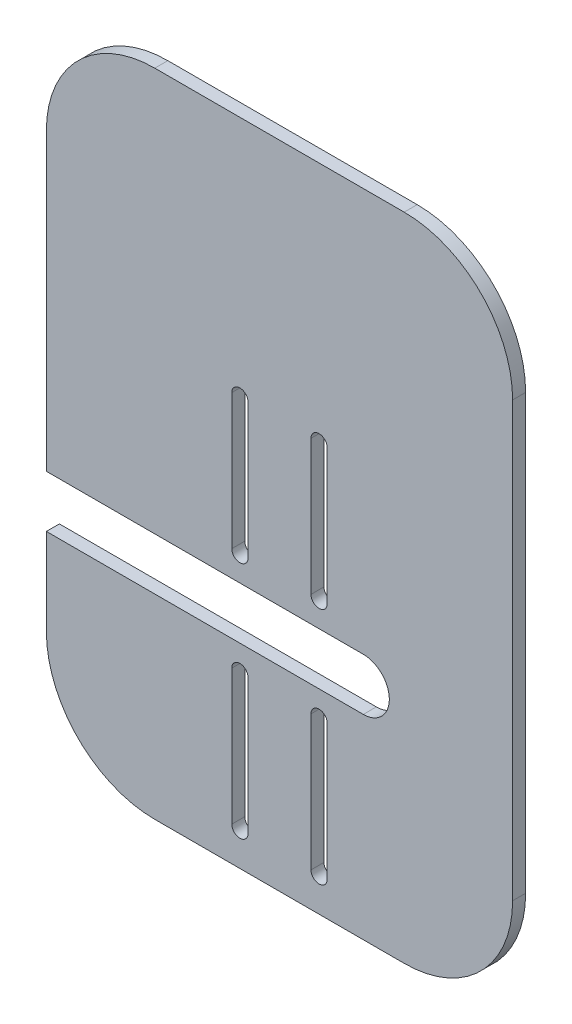
ISO-10303-21;
HEADER;
FILE_DESCRIPTION(('STEP AP214'),'2;1');
FILE_NAME('part.step','',(''),(''),'','','');
FILE_SCHEMA(('AUTOMOTIVE_DESIGN { 1 0 10303 214 1 1 1 1 }'));
ENDSEC;
DATA;
#1=APPLICATION_CONTEXT('core data for automotive mechanical design processes');
#2=APPLICATION_PROTOCOL_DEFINITION('international standard','automotive_design',2000,#1);
#3=PRODUCT_CONTEXT('',#1,'mechanical');
#4=PRODUCT('Part','Part','',(#3));
#5=PRODUCT_RELATED_PRODUCT_CATEGORY('part','',(#4));
#6=PRODUCT_DEFINITION_FORMATION('','',#4);
#7=PRODUCT_DEFINITION_CONTEXT('part definition',#1,'design');
#8=PRODUCT_DEFINITION('design','',#6,#7);
#9=PRODUCT_DEFINITION_SHAPE('','',#8);
#10=(LENGTH_UNIT() NAMED_UNIT(*) SI_UNIT(.MILLI.,.METRE.));
#11=(NAMED_UNIT(*) PLANE_ANGLE_UNIT() SI_UNIT($,.RADIAN.));
#12=(NAMED_UNIT(*) SI_UNIT($,.STERADIAN.) SOLID_ANGLE_UNIT());
#13=UNCERTAINTY_MEASURE_WITH_UNIT(LENGTH_MEASURE(1.E-05),#10,'distance_accuracy_value','');
#14=(GEOMETRIC_REPRESENTATION_CONTEXT(3) GLOBAL_UNCERTAINTY_ASSIGNED_CONTEXT((#13)) GLOBAL_UNIT_ASSIGNED_CONTEXT((#10,
#11,#12)) REPRESENTATION_CONTEXT('',''));
#15=CARTESIAN_POINT('',(0.,0.,0.));
#16=DIRECTION('',(0.,0.,1.));
#17=DIRECTION('',(1.,0.,0.));
#18=AXIS2_PLACEMENT_3D('',#15,#16,#17);
#19=CARTESIAN_POINT('',(-53.1286344218914,-25.5475887011216,3.));
#20=DIRECTION('',(0.,0.,-1.));
#21=DIRECTION('',(-1.,0.,0.));
#22=AXIS2_PLACEMENT_3D('',#19,#20,#21);
#23=CYLINDRICAL_SURFACE('',#22,5.99999999999999);
#24=CARTESIAN_POINT('',(-53.1286344218914,-25.5475887011216,0.));
#25=DIRECTION('',(0.,0.,-1.));
#26=DIRECTION('',(1.,0.,0.));
#27=AXIS2_PLACEMENT_3D('',#24,#25,#26);
#28=CIRCLE('',#27,5.99999999999999);
#29=CARTESIAN_POINT('',(-53.1286344218914,-19.5475887011216,0.));
#30=VERTEX_POINT('',#29);
#31=CARTESIAN_POINT('',(-53.1286344218914,-31.5475887011216,0.));
#32=VERTEX_POINT('',#31);
#33=EDGE_CURVE('E299',#30,#32,#28,.T.);
#34=ORIENTED_EDGE('',*,*,#33,.T.);
#35=DIRECTION('',(0.,0.,-1.));
#36=VECTOR('',#35,1.);
#37=CARTESIAN_POINT('',(-53.1286344218914,-31.5475887011216,3.));
#38=LINE('',#37,#36);
#39=CARTESIAN_POINT('',(-53.1286344218914,-31.5475887011216,3.));
#40=VERTEX_POINT('',#39);
#41=EDGE_CURVE('E389',#40,#32,#38,.T.);
#42=ORIENTED_EDGE('',*,*,#41,.F.);
#43=CARTESIAN_POINT('',(-53.1286344218914,-25.5475887011216,3.));
#44=DIRECTION('',(0.,0.,-1.));
#45=DIRECTION('',(1.,0.,0.));
#46=AXIS2_PLACEMENT_3D('',#43,#44,#45);
#47=CIRCLE('',#46,5.99999999999999);
#48=CARTESIAN_POINT('',(-53.1286344218914,-19.5475887011216,3.));
#49=VERTEX_POINT('',#48);
#50=EDGE_CURVE('E306',#49,#40,#47,.T.);
#51=ORIENTED_EDGE('',*,*,#50,.F.);
#52=DIRECTION('',(0.,0.,-1.));
#53=VECTOR('',#52,1.);
#54=CARTESIAN_POINT('',(-53.1286344218914,-19.5475887011216,3.));
#55=LINE('',#54,#53);
#56=EDGE_CURVE('E332',#49,#30,#55,.T.);
#57=ORIENTED_EDGE('',*,*,#56,.T.);
#58=EDGE_LOOP('',(#34,#42,#51,#57));
#59=FACE_BOUND('',#58,.T.);
#60=ADVANCED_FACE('F33',(#59),#23,.F.);
#61=CARTESIAN_POINT('',(-62.7468099752932,-31.5475887011216,3.));
#62=DIRECTION('',(0.,-1.,0.));
#63=DIRECTION('',(1.,0.,0.));
#64=AXIS2_PLACEMENT_3D('',#61,#62,#63);
#65=PLANE('',#64);
#66=DIRECTION('',(-1.,0.,0.));
#67=VECTOR('',#66,1.);
#68=CARTESIAN_POINT('',(-62.7468099752932,-31.5475887011216,0.));
#69=LINE('',#68,#67);
#70=CARTESIAN_POINT('',(-126.203620944525,-31.5475887011216,0.));
#71=VERTEX_POINT('',#70);
#72=EDGE_CURVE('E335',#32,#71,#69,.T.);
#73=ORIENTED_EDGE('',*,*,#72,.T.);
#74=DIRECTION('',(0.,0.,-1.));
#75=VECTOR('',#74,1.);
#76=CARTESIAN_POINT('',(-126.203620944525,-31.5475887011216,3.));
#77=LINE('',#76,#75);
#78=CARTESIAN_POINT('',(-126.203620944525,-31.5475887011216,3.));
#79=VERTEX_POINT('',#78);
#80=EDGE_CURVE('E386',#79,#71,#77,.T.);
#81=ORIENTED_EDGE('',*,*,#80,.F.);
#82=DIRECTION('',(-1.,0.,0.));
#83=VECTOR('',#82,1.);
#84=CARTESIAN_POINT('',(-53.1286344218914,-31.5475887011216,3.));
#85=LINE('',#84,#83);
#86=EDGE_CURVE('E309',#40,#79,#85,.T.);
#87=ORIENTED_EDGE('',*,*,#86,.F.);
#88=ORIENTED_EDGE('',*,*,#41,.T.);
#89=EDGE_LOOP('',(#73,#81,#87,#88));
#90=FACE_BOUND('',#89,.T.);
#91=ADVANCED_FACE('F452',(#90),#65,.F.);
#92=CARTESIAN_POINT('',(-126.203620944525,-31.5475887011216,3.));
#93=DIRECTION('',(1.,0.,0.));
#94=DIRECTION('',(0.,0.,-1.));
#95=AXIS2_PLACEMENT_3D('',#92,#93,#94);
#96=PLANE('',#95);
#97=DIRECTION('',(0.,-1.,0.));
#98=VECTOR('',#97,1.);
#99=CARTESIAN_POINT('',(-126.203620944525,-31.5475887011216,0.));
#100=LINE('',#99,#98);
#101=CARTESIAN_POINT('',(-126.203620944525,-51.5475887011216,0.));
#102=VERTEX_POINT('',#101);
#103=EDGE_CURVE('E337',#71,#102,#100,.T.);
#104=ORIENTED_EDGE('',*,*,#103,.T.);
#105=DIRECTION('',(0.,0.,-1.));
#106=VECTOR('',#105,1.);
#107=CARTESIAN_POINT('',(-126.203620944525,-51.5475887011216,3.));
#108=LINE('',#107,#106);
#109=CARTESIAN_POINT('',(-126.203620944525,-51.5475887011216,3.));
#110=VERTEX_POINT('',#109);
#111=EDGE_CURVE('E383',#110,#102,#108,.T.);
#112=ORIENTED_EDGE('',*,*,#111,.F.);
#113=DIRECTION('',(0.,-1.,0.));
#114=VECTOR('',#113,1.);
#115=CARTESIAN_POINT('',(-126.203620944525,-31.5475887011216,3.));
#116=LINE('',#115,#114);
#117=EDGE_CURVE('E312',#79,#110,#116,.T.);
#118=ORIENTED_EDGE('',*,*,#117,.F.);
#119=ORIENTED_EDGE('',*,*,#80,.T.);
#120=EDGE_LOOP('',(#104,#112,#118,#119));
#121=FACE_BOUND('',#120,.T.);
#122=ADVANCED_FACE('F457',(#121),#96,.F.);
#123=CARTESIAN_POINT('',(-101.203620944525,-51.5475887011216,3.));
#124=DIRECTION('',(0.,0.,-1.));
#125=DIRECTION('',(-1.,0.,0.));
#126=AXIS2_PLACEMENT_3D('',#123,#124,#125);
#127=CYLINDRICAL_SURFACE('',#126,25.);
#128=CARTESIAN_POINT('',(-101.203620944525,-51.5475887011216,0.));
#129=DIRECTION('',(0.,0.,1.));
#130=DIRECTION('',(-1.,0.,0.));
#131=AXIS2_PLACEMENT_3D('',#128,#129,#130);
#132=CIRCLE('',#131,25.);
#133=CARTESIAN_POINT('',(-101.203620944525,-76.5475887011216,0.));
#134=VERTEX_POINT('',#133);
#135=EDGE_CURVE('E339',#102,#134,#132,.T.);
#136=ORIENTED_EDGE('',*,*,#135,.T.);
#137=DIRECTION('',(0.,0.,-1.));
#138=VECTOR('',#137,1.);
#139=CARTESIAN_POINT('',(-101.203620944525,-76.5475887011216,3.));
#140=LINE('',#139,#138);
#141=CARTESIAN_POINT('',(-101.203620944525,-76.5475887011216,3.));
#142=VERTEX_POINT('',#141);
#143=EDGE_CURVE('E380',#142,#134,#140,.T.);
#144=ORIENTED_EDGE('',*,*,#143,.F.);
#145=CARTESIAN_POINT('',(-101.203620944525,-51.5475887011216,3.));
#146=DIRECTION('',(0.,0.,1.));
#147=DIRECTION('',(-1.,0.,0.));
#148=AXIS2_PLACEMENT_3D('',#145,#146,#147);
#149=CIRCLE('',#148,25.);
#150=EDGE_CURVE('E314',#110,#142,#149,.T.);
#151=ORIENTED_EDGE('',*,*,#150,.F.);
#152=ORIENTED_EDGE('',*,*,#111,.T.);
#153=EDGE_LOOP('',(#136,#144,#151,#152));
#154=FACE_BOUND('',#153,.T.);
#155=ADVANCED_FACE('F509',(#154),#127,.T.);
#156=CARTESIAN_POINT('',(-101.203620944525,-76.5475887011216,3.));
#157=DIRECTION('',(0.,1.,0.));
#158=DIRECTION('',(0.,0.,1.));
#159=AXIS2_PLACEMENT_3D('',#156,#157,#158);
#160=PLANE('',#159);
#161=DIRECTION('',(1.,0.,0.));
#162=VECTOR('',#161,1.);
#163=CARTESIAN_POINT('',(-101.203620944525,-76.5475887011216,0.));
#164=LINE('',#163,#162);
#165=CARTESIAN_POINT('',(-43.7036209445248,-76.5475887011216,0.));
#166=VERTEX_POINT('',#165);
#167=EDGE_CURVE('E341',#134,#166,#164,.T.);
#168=ORIENTED_EDGE('',*,*,#167,.T.);
#169=DIRECTION('',(0.,0.,-1.));
#170=VECTOR('',#169,1.);
#171=CARTESIAN_POINT('',(-43.7036209445248,-76.5475887011216,3.));
#172=LINE('',#171,#170);
#173=CARTESIAN_POINT('',(-43.7036209445248,-76.5475887011216,3.));
#174=VERTEX_POINT('',#173);
#175=EDGE_CURVE('E377',#174,#166,#172,.T.);
#176=ORIENTED_EDGE('',*,*,#175,.F.);
#177=DIRECTION('',(1.,0.,0.));
#178=VECTOR('',#177,1.);
#179=CARTESIAN_POINT('',(-101.203620944525,-76.5475887011216,3.));
#180=LINE('',#179,#178);
#181=EDGE_CURVE('E316',#142,#174,#180,.T.);
#182=ORIENTED_EDGE('',*,*,#181,.F.);
#183=ORIENTED_EDGE('',*,*,#143,.T.);
#184=EDGE_LOOP('',(#168,#176,#182,#183));
#185=FACE_BOUND('',#184,.T.);
#186=ADVANCED_FACE('F506',(#185),#160,.F.);
#187=CARTESIAN_POINT('',(-43.7036209445248,-51.5475887011216,3.));
#188=DIRECTION('',(0.,0.,-1.));
#189=DIRECTION('',(-1.,0.,0.));
#190=AXIS2_PLACEMENT_3D('',#187,#188,#189);
#191=CYLINDRICAL_SURFACE('',#190,25.);
#192=CARTESIAN_POINT('',(-43.7036209445248,-51.5475887011216,0.));
#193=DIRECTION('',(0.,0.,1.));
#194=DIRECTION('',(-1.,0.,0.));
#195=AXIS2_PLACEMENT_3D('',#192,#193,#194);
#196=CIRCLE('',#195,25.);
#197=CARTESIAN_POINT('',(-18.7036209445248,-51.5475887011216,0.));
#198=VERTEX_POINT('',#197);
#199=EDGE_CURVE('E343',#166,#198,#196,.T.);
#200=ORIENTED_EDGE('',*,*,#199,.T.);
#201=DIRECTION('',(0.,0.,-1.));
#202=VECTOR('',#201,1.);
#203=CARTESIAN_POINT('',(-18.7036209445248,-51.5475887011216,3.));
#204=LINE('',#203,#202);
#205=CARTESIAN_POINT('',(-18.7036209445248,-51.5475887011216,3.));
#206=VERTEX_POINT('',#205);
#207=EDGE_CURVE('E374',#206,#198,#204,.T.);
#208=ORIENTED_EDGE('',*,*,#207,.F.);
#209=CARTESIAN_POINT('',(-43.7036209445248,-51.5475887011216,3.));
#210=DIRECTION('',(0.,0.,1.));
#211=DIRECTION('',(-1.,0.,0.));
#212=AXIS2_PLACEMENT_3D('',#209,#210,#211);
#213=CIRCLE('',#212,25.);
#214=EDGE_CURVE('E318',#174,#206,#213,.T.);
#215=ORIENTED_EDGE('',*,*,#214,.F.);
#216=ORIENTED_EDGE('',*,*,#175,.T.);
#217=EDGE_LOOP('',(#200,#208,#215,#216));
#218=FACE_BOUND('',#217,.T.);
#219=ADVANCED_FACE('F502',(#218),#191,.T.);
#220=CARTESIAN_POINT('',(-18.7036209445248,48.4524112988784,3.));
#221=DIRECTION('',(-1.,0.,0.));
#222=DIRECTION('',(0.,0.,1.));
#223=AXIS2_PLACEMENT_3D('',#220,#221,#222);
#224=PLANE('',#223);
#225=DIRECTION('',(0.,1.,0.));
#226=VECTOR('',#225,1.);
#227=CARTESIAN_POINT('',(-18.7036209445248,48.4524112988784,0.));
#228=LINE('',#227,#226);
#229=CARTESIAN_POINT('',(-18.7036209445248,48.4524112988784,0.));
#230=VERTEX_POINT('',#229);
#231=EDGE_CURVE('E345',#198,#230,#228,.T.);
#232=ORIENTED_EDGE('',*,*,#231,.T.);
#233=DIRECTION('',(0.,0.,-1.));
#234=VECTOR('',#233,1.);
#235=CARTESIAN_POINT('',(-18.7036209445248,48.4524112988784,3.));
#236=LINE('',#235,#234);
#237=CARTESIAN_POINT('',(-18.7036209445248,48.4524112988784,3.));
#238=VERTEX_POINT('',#237);
#239=EDGE_CURVE('E371',#238,#230,#236,.T.);
#240=ORIENTED_EDGE('',*,*,#239,.F.);
#241=DIRECTION('',(0.,1.,0.));
#242=VECTOR('',#241,1.);
#243=CARTESIAN_POINT('',(-18.7036209445248,48.4524112988784,3.));
#244=LINE('',#243,#242);
#245=EDGE_CURVE('E320',#206,#238,#244,.T.);
#246=ORIENTED_EDGE('',*,*,#245,.F.);
#247=ORIENTED_EDGE('',*,*,#207,.T.);
#248=EDGE_LOOP('',(#232,#240,#246,#247));
#249=FACE_BOUND('',#248,.T.);
#250=ADVANCED_FACE('F497',(#249),#224,.F.);
#251=CARTESIAN_POINT('',(-43.7036209445248,48.4524112988784,3.));
#252=DIRECTION('',(0.,0.,-1.));
#253=DIRECTION('',(-1.,0.,0.));
#254=AXIS2_PLACEMENT_3D('',#251,#252,#253);
#255=CYLINDRICAL_SURFACE('',#254,25.);
#256=CARTESIAN_POINT('',(-43.7036209445248,48.4524112988784,0.));
#257=DIRECTION('',(0.,0.,1.));
#258=DIRECTION('',(-1.,0.,0.));
#259=AXIS2_PLACEMENT_3D('',#256,#257,#258);
#260=CIRCLE('',#259,25.);
#261=CARTESIAN_POINT('',(-43.7036209445248,73.4524112988784,0.));
#262=VERTEX_POINT('',#261);
#263=EDGE_CURVE('E347',#230,#262,#260,.T.);
#264=ORIENTED_EDGE('',*,*,#263,.T.);
#265=DIRECTION('',(0.,0.,-1.));
#266=VECTOR('',#265,1.);
#267=CARTESIAN_POINT('',(-43.7036209445248,73.4524112988784,3.));
#268=LINE('',#267,#266);
#269=CARTESIAN_POINT('',(-43.7036209445248,73.4524112988784,3.));
#270=VERTEX_POINT('',#269);
#271=EDGE_CURVE('E368',#270,#262,#268,.T.);
#272=ORIENTED_EDGE('',*,*,#271,.F.);
#273=CARTESIAN_POINT('',(-43.7036209445248,48.4524112988784,3.));
#274=DIRECTION('',(0.,0.,1.));
#275=DIRECTION('',(-1.,0.,0.));
#276=AXIS2_PLACEMENT_3D('',#273,#274,#275);
#277=CIRCLE('',#276,25.);
#278=EDGE_CURVE('E322',#238,#270,#277,.T.);
#279=ORIENTED_EDGE('',*,*,#278,.F.);
#280=ORIENTED_EDGE('',*,*,#239,.T.);
#281=EDGE_LOOP('',(#264,#272,#279,#280));
#282=FACE_BOUND('',#281,.T.);
#283=ADVANCED_FACE('F491',(#282),#255,.T.);
#284=CARTESIAN_POINT('',(-101.203620944525,73.4524112988784,3.));
#285=DIRECTION('',(0.,-1.,0.));
#286=DIRECTION('',(0.,0.,-1.));
#287=AXIS2_PLACEMENT_3D('',#284,#285,#286);
#288=PLANE('',#287);
#289=DIRECTION('',(-1.,0.,0.));
#290=VECTOR('',#289,1.);
#291=CARTESIAN_POINT('',(-101.203620944525,73.4524112988784,0.));
#292=LINE('',#291,#290);
#293=CARTESIAN_POINT('',(-101.203620944525,73.4524112988784,0.));
#294=VERTEX_POINT('',#293);
#295=EDGE_CURVE('E349',#262,#294,#292,.T.);
#296=ORIENTED_EDGE('',*,*,#295,.T.);
#297=DIRECTION('',(0.,0.,-1.));
#298=VECTOR('',#297,1.);
#299=CARTESIAN_POINT('',(-101.203620944525,73.4524112988784,3.));
#300=LINE('',#299,#298);
#301=CARTESIAN_POINT('',(-101.203620944525,73.4524112988784,3.));
#302=VERTEX_POINT('',#301);
#303=EDGE_CURVE('E365',#302,#294,#300,.T.);
#304=ORIENTED_EDGE('',*,*,#303,.F.);
#305=DIRECTION('',(-1.,0.,0.));
#306=VECTOR('',#305,1.);
#307=CARTESIAN_POINT('',(-101.203620944525,73.4524112988784,3.));
#308=LINE('',#307,#306);
#309=EDGE_CURVE('E324',#270,#302,#308,.T.);
#310=ORIENTED_EDGE('',*,*,#309,.F.);
#311=ORIENTED_EDGE('',*,*,#271,.T.);
#312=EDGE_LOOP('',(#296,#304,#310,#311));
#313=FACE_BOUND('',#312,.T.);
#314=ADVANCED_FACE('F487',(#313),#288,.F.);
#315=CARTESIAN_POINT('',(-101.203620944525,48.4524112988784,3.));
#316=DIRECTION('',(0.,0.,-1.));
#317=DIRECTION('',(-1.,0.,0.));
#318=AXIS2_PLACEMENT_3D('',#315,#316,#317);
#319=CYLINDRICAL_SURFACE('',#318,25.);
#320=CARTESIAN_POINT('',(-101.203620944525,48.4524112988784,0.));
#321=DIRECTION('',(0.,0.,1.));
#322=DIRECTION('',(1.,0.,0.));
#323=AXIS2_PLACEMENT_3D('',#320,#321,#322);
#324=CIRCLE('',#323,25.);
#325=CARTESIAN_POINT('',(-126.203620944525,48.4524112988784,0.));
#326=VERTEX_POINT('',#325);
#327=EDGE_CURVE('E351',#294,#326,#324,.T.);
#328=ORIENTED_EDGE('',*,*,#327,.T.);
#329=DIRECTION('',(0.,0.,-1.));
#330=VECTOR('',#329,1.);
#331=CARTESIAN_POINT('',(-126.203620944525,48.4524112988784,3.));
#332=LINE('',#331,#330);
#333=CARTESIAN_POINT('',(-126.203620944525,48.4524112988784,3.));
#334=VERTEX_POINT('',#333);
#335=EDGE_CURVE('E362',#334,#326,#332,.T.);
#336=ORIENTED_EDGE('',*,*,#335,.F.);
#337=CARTESIAN_POINT('',(-101.203620944525,48.4524112988784,3.));
#338=DIRECTION('',(0.,0.,1.));
#339=DIRECTION('',(1.,0.,0.));
#340=AXIS2_PLACEMENT_3D('',#337,#338,#339);
#341=CIRCLE('',#340,25.);
#342=EDGE_CURVE('E326',#302,#334,#341,.T.);
#343=ORIENTED_EDGE('',*,*,#342,.F.);
#344=ORIENTED_EDGE('',*,*,#303,.T.);
#345=EDGE_LOOP('',(#328,#336,#343,#344));
#346=FACE_BOUND('',#345,.T.);
#347=ADVANCED_FACE('F482',(#346),#319,.T.);
#348=CARTESIAN_POINT('',(-126.203620944525,48.4524112988784,3.));
#349=DIRECTION('',(1.,0.,0.));
#350=DIRECTION('',(0.,0.,-1.));
#351=AXIS2_PLACEMENT_3D('',#348,#349,#350);
#352=PLANE('',#351);
#353=DIRECTION('',(0.,-1.,0.));
#354=VECTOR('',#353,1.);
#355=CARTESIAN_POINT('',(-126.203620944525,48.4524112988784,0.));
#356=LINE('',#355,#354);
#357=CARTESIAN_POINT('',(-126.203620944525,-19.5475887011217,0.));
#358=VERTEX_POINT('',#357);
#359=EDGE_CURVE('E353',#326,#358,#356,.T.);
#360=ORIENTED_EDGE('',*,*,#359,.T.);
#361=DIRECTION('',(0.,0.,-1.));
#362=VECTOR('',#361,1.);
#363=CARTESIAN_POINT('',(-126.203620944525,-19.5475887011217,3.));
#364=LINE('',#363,#362);
#365=CARTESIAN_POINT('',(-126.203620944525,-19.5475887011217,3.));
#366=VERTEX_POINT('',#365);
#367=EDGE_CURVE('E359',#366,#358,#364,.T.);
#368=ORIENTED_EDGE('',*,*,#367,.F.);
#369=DIRECTION('',(0.,-1.,0.));
#370=VECTOR('',#369,1.);
#371=CARTESIAN_POINT('',(-126.203620944525,48.4524112988784,3.));
#372=LINE('',#371,#370);
#373=EDGE_CURVE('E328',#334,#366,#372,.T.);
#374=ORIENTED_EDGE('',*,*,#373,.F.);
#375=ORIENTED_EDGE('',*,*,#335,.T.);
#376=EDGE_LOOP('',(#360,#368,#374,#375));
#377=FACE_BOUND('',#376,.T.);
#378=ADVANCED_FACE('F476',(#377),#352,.F.);
#379=CARTESIAN_POINT('',(-53.1286344218914,-19.5475887011216,3.));
#380=DIRECTION('',(0.,1.,0.));
#381=DIRECTION('',(-1.,0.,0.));
#382=AXIS2_PLACEMENT_3D('',#379,#380,#381);
#383=PLANE('',#382);
#384=DIRECTION('',(1.,0.,0.));
#385=VECTOR('',#384,1.);
#386=CARTESIAN_POINT('',(-53.1286344218914,-19.5475887011216,0.));
#387=LINE('',#386,#385);
#388=EDGE_CURVE('E310',#358,#30,#387,.T.);
#389=ORIENTED_EDGE('',*,*,#388,.T.);
#390=ORIENTED_EDGE('',*,*,#56,.F.);
#391=DIRECTION('',(1.,0.,0.));
#392=VECTOR('',#391,1.);
#393=CARTESIAN_POINT('',(-62.7468099752932,-19.5475887011216,3.));
#394=LINE('',#393,#392);
#395=EDGE_CURVE('E330',#366,#49,#394,.T.);
#396=ORIENTED_EDGE('',*,*,#395,.F.);
#397=ORIENTED_EDGE('',*,*,#367,.T.);
#398=EDGE_LOOP('',(#389,#390,#396,#397));
#399=FACE_BOUND('',#398,.T.);
#400=ADVANCED_FACE('F474',(#399),#383,.F.);
#401=CARTESIAN_POINT('',(-53.1286344218914,-25.5475887011216,3.));
#402=DIRECTION('',(0.,0.,1.));
#403=DIRECTION('',(1.,0.,0.));
#404=AXIS2_PLACEMENT_3D('',#401,#402,#403);
#405=PLANE('',#404);
#406=CARTESIAN_POINT('',(-63.3236209445248,-13.6186146300551,3.));
#407=DIRECTION('',(0.,0.,1.));
#408=DIRECTION('',(-1.,0.,0.));
#409=AXIS2_PLACEMENT_3D('',#406,#407,#408);
#410=CIRCLE('',#409,1.875);
#411=CARTESIAN_POINT('',(-65.1986209445248,-13.6186146300551,3.));
#412=VERTEX_POINT('',#411);
#413=CARTESIAN_POINT('',(-61.4486209445248,-13.6186146300551,3.));
#414=VERTEX_POINT('',#413);
#415=EDGE_CURVE('E47',#412,#414,#410,.T.);
#416=ORIENTED_EDGE('',*,*,#415,.F.);
#417=DIRECTION('',(0.,-1.,0.));
#418=VECTOR('',#417,1.);
#419=CARTESIAN_POINT('',(-65.1986209445248,-13.6186146300551,3.));
#420=LINE('',#419,#418);
#421=CARTESIAN_POINT('',(-65.1986209445248,17.5366622973474,3.));
#422=VERTEX_POINT('',#421);
#423=EDGE_CURVE('E236',#422,#412,#420,.T.);
#424=ORIENTED_EDGE('',*,*,#423,.F.);
#425=CARTESIAN_POINT('',(-63.3236209445248,17.5366622973474,3.));
#426=DIRECTION('',(0.,0.,1.));
#427=DIRECTION('',(-1.,0.,0.));
#428=AXIS2_PLACEMENT_3D('',#425,#426,#427);
#429=CIRCLE('',#428,1.87500000000001);
#430=CARTESIAN_POINT('',(-61.4486209445248,17.5366622973474,3.));
#431=VERTEX_POINT('',#430);
#432=EDGE_CURVE('E220',#431,#422,#429,.T.);
#433=ORIENTED_EDGE('',*,*,#432,.F.);
#434=DIRECTION('',(0.,1.,0.));
#435=VECTOR('',#434,1.);
#436=CARTESIAN_POINT('',(-61.4486209445248,-13.6186146300551,3.));
#437=LINE('',#436,#435);
#438=EDGE_CURVE('E229',#414,#431,#437,.T.);
#439=ORIENTED_EDGE('',*,*,#438,.F.);
#440=EDGE_LOOP('',(#416,#424,#433,#439));
#441=FACE_BOUND('',#440,.T.);
#442=CARTESIAN_POINT('',(-81.5836209445248,-13.6186146300551,3.));
#443=DIRECTION('',(0.,0.,1.));
#444=DIRECTION('',(1.,0.,0.));
#445=AXIS2_PLACEMENT_3D('',#442,#443,#444);
#446=CIRCLE('',#445,1.87499999999999);
#447=CARTESIAN_POINT('',(-83.4586209445248,-13.6186146300551,3.));
#448=VERTEX_POINT('',#447);
#449=CARTESIAN_POINT('',(-79.7086209445248,-13.6186146300551,3.));
#450=VERTEX_POINT('',#449);
#451=EDGE_CURVE('E243',#448,#450,#446,.T.);
#452=ORIENTED_EDGE('',*,*,#451,.F.);
#453=DIRECTION('',(0.,-1.,0.));
#454=VECTOR('',#453,1.);
#455=CARTESIAN_POINT('',(-83.4586209445248,-13.6186146300551,3.));
#456=LINE('',#455,#454);
#457=CARTESIAN_POINT('',(-83.4586209445248,17.5366622973474,3.));
#458=VERTEX_POINT('',#457);
#459=EDGE_CURVE('E253',#458,#448,#456,.T.);
#460=ORIENTED_EDGE('',*,*,#459,.F.);
#461=CARTESIAN_POINT('',(-81.5836209445248,17.5366622973474,3.));
#462=DIRECTION('',(0.,0.,1.));
#463=DIRECTION('',(1.,0.,0.));
#464=AXIS2_PLACEMENT_3D('',#461,#462,#463);
#465=CIRCLE('',#464,1.87500000000001);
#466=CARTESIAN_POINT('',(-79.7086209445248,17.5366622973474,3.));
#467=VERTEX_POINT('',#466);
#468=EDGE_CURVE('E250',#467,#458,#465,.T.);
#469=ORIENTED_EDGE('',*,*,#468,.F.);
#470=DIRECTION('',(0.,1.,0.));
#471=VECTOR('',#470,1.);
#472=CARTESIAN_POINT('',(-79.7086209445248,-13.6186146300551,3.));
#473=LINE('',#472,#471);
#474=EDGE_CURVE('E247',#450,#467,#473,.T.);
#475=ORIENTED_EDGE('',*,*,#474,.F.);
#476=EDGE_LOOP('',(#452,#460,#469,#475));
#477=FACE_BOUND('',#476,.T.);
#478=CARTESIAN_POINT('',(-81.5836209445248,-37.4765627721882,3.));
#479=DIRECTION('',(0.,0.,1.));
#480=DIRECTION('',(-1.,0.,0.));
#481=AXIS2_PLACEMENT_3D('',#478,#479,#480);
#482=CIRCLE('',#481,1.87499999999999);
#483=CARTESIAN_POINT('',(-79.7086209445248,-37.4765627721882,3.));
#484=VERTEX_POINT('',#483);
#485=CARTESIAN_POINT('',(-83.4586209445248,-37.4765627721882,3.));
#486=VERTEX_POINT('',#485);
#487=EDGE_CURVE('E259',#484,#486,#482,.T.);
#488=ORIENTED_EDGE('',*,*,#487,.F.);
#489=DIRECTION('',(0.,1.,0.));
#490=VECTOR('',#489,1.);
#491=CARTESIAN_POINT('',(-79.7086209445248,-37.4765627721882,3.));
#492=LINE('',#491,#490);
#493=CARTESIAN_POINT('',(-79.7086209445248,-68.6318396995907,3.));
#494=VERTEX_POINT('',#493);
#495=EDGE_CURVE('E273',#494,#484,#492,.T.);
#496=ORIENTED_EDGE('',*,*,#495,.F.);
#497=CARTESIAN_POINT('',(-81.5836209445248,-68.6318396995907,3.));
#498=DIRECTION('',(0.,0.,1.));
#499=DIRECTION('',(-1.,0.,0.));
#500=AXIS2_PLACEMENT_3D('',#497,#498,#499);
#501=CIRCLE('',#500,1.87500000000001);
#502=CARTESIAN_POINT('',(-83.4586209445248,-68.6318396995907,3.));
#503=VERTEX_POINT('',#502);
#504=EDGE_CURVE('E270',#503,#494,#501,.T.);
#505=ORIENTED_EDGE('',*,*,#504,.F.);
#506=DIRECTION('',(0.,-1.,0.));
#507=VECTOR('',#506,1.);
#508=CARTESIAN_POINT('',(-83.4586209445248,-37.4765627721882,3.));
#509=LINE('',#508,#507);
#510=EDGE_CURVE('E267',#486,#503,#509,.T.);
#511=ORIENTED_EDGE('',*,*,#510,.F.);
#512=EDGE_LOOP('',(#488,#496,#505,#511));
#513=FACE_BOUND('',#512,.T.);
#514=CARTESIAN_POINT('',(-63.3236209445248,-37.4765627721882,3.));
#515=DIRECTION('',(0.,0.,1.));
#516=DIRECTION('',(1.,0.,0.));
#517=AXIS2_PLACEMENT_3D('',#514,#515,#516);
#518=CIRCLE('',#517,1.875);
#519=CARTESIAN_POINT('',(-61.4486209445248,-37.4765627721882,3.));
#520=VERTEX_POINT('',#519);
#521=CARTESIAN_POINT('',(-65.1986209445248,-37.4765627721882,3.));
#522=VERTEX_POINT('',#521);
#523=EDGE_CURVE('E279',#520,#522,#518,.T.);
#524=ORIENTED_EDGE('',*,*,#523,.F.);
#525=DIRECTION('',(0.,1.,0.));
#526=VECTOR('',#525,1.);
#527=CARTESIAN_POINT('',(-61.4486209445248,-37.4765627721882,3.));
#528=LINE('',#527,#526);
#529=CARTESIAN_POINT('',(-61.4486209445248,-68.6318396995907,3.));
#530=VERTEX_POINT('',#529);
#531=EDGE_CURVE('E293',#530,#520,#528,.T.);
#532=ORIENTED_EDGE('',*,*,#531,.F.);
#533=CARTESIAN_POINT('',(-63.3236209445248,-68.6318396995907,3.));
#534=DIRECTION('',(0.,0.,1.));
#535=DIRECTION('',(1.,0.,0.));
#536=AXIS2_PLACEMENT_3D('',#533,#534,#535);
#537=CIRCLE('',#536,1.87500000000001);
#538=CARTESIAN_POINT('',(-65.1986209445248,-68.6318396995907,3.));
#539=VERTEX_POINT('',#538);
#540=EDGE_CURVE('E290',#539,#530,#537,.T.);
#541=ORIENTED_EDGE('',*,*,#540,.F.);
#542=DIRECTION('',(0.,-1.,0.));
#543=VECTOR('',#542,1.);
#544=CARTESIAN_POINT('',(-65.1986209445248,-37.4765627721882,3.));
#545=LINE('',#544,#543);
#546=EDGE_CURVE('E287',#522,#539,#545,.T.);
#547=ORIENTED_EDGE('',*,*,#546,.F.);
#548=EDGE_LOOP('',(#524,#532,#541,#547));
#549=FACE_BOUND('',#548,.T.);
#550=ORIENTED_EDGE('',*,*,#50,.T.);
#551=ORIENTED_EDGE('',*,*,#86,.T.);
#552=ORIENTED_EDGE('',*,*,#117,.T.);
#553=ORIENTED_EDGE('',*,*,#150,.T.);
#554=ORIENTED_EDGE('',*,*,#181,.T.);
#555=ORIENTED_EDGE('',*,*,#214,.T.);
#556=ORIENTED_EDGE('',*,*,#245,.T.);
#557=ORIENTED_EDGE('',*,*,#278,.T.);
#558=ORIENTED_EDGE('',*,*,#309,.T.);
#559=ORIENTED_EDGE('',*,*,#342,.T.);
#560=ORIENTED_EDGE('',*,*,#373,.T.);
#561=ORIENTED_EDGE('',*,*,#395,.T.);
#562=EDGE_LOOP('',(#550,#551,#552,#553,#554,#555,#556,#557,#558,#559,#560,#561));
#563=FACE_BOUND('',#562,.T.);
#564=ADVANCED_FACE('F233',(#441,#477,#513,#549,#563),#405,.T.);
#565=CARTESIAN_POINT('',(-53.1286344218914,-25.5475887011216,0.));
#566=DIRECTION('',(0.,0.,1.));
#567=DIRECTION('',(1.,0.,0.));
#568=AXIS2_PLACEMENT_3D('',#565,#566,#567);
#569=PLANE('',#568);
#570=DIRECTION('',(0.,-1.,0.));
#571=VECTOR('',#570,1.);
#572=CARTESIAN_POINT('',(-65.1986209445248,-25.5475887011216,0.));
#573=LINE('',#572,#571);
#574=CARTESIAN_POINT('',(-65.1986209445248,17.5366622973474,0.));
#575=VERTEX_POINT('',#574);
#576=CARTESIAN_POINT('',(-65.1986209445248,-13.6186146300551,0.));
#577=VERTEX_POINT('',#576);
#578=EDGE_CURVE('E40',#575,#577,#573,.T.);
#579=ORIENTED_EDGE('',*,*,#578,.T.);
#580=CARTESIAN_POINT('',(-63.3236209445248,-13.6186146300551,0.));
#581=DIRECTION('',(0.,0.,1.));
#582=DIRECTION('',(1.,0.,0.));
#583=AXIS2_PLACEMENT_3D('',#580,#581,#582);
#584=CIRCLE('',#583,1.875);
#585=CARTESIAN_POINT('',(-61.4486209445248,-13.6186146300551,0.));
#586=VERTEX_POINT('',#585);
#587=EDGE_CURVE('E11',#577,#586,#584,.T.);
#588=ORIENTED_EDGE('',*,*,#587,.T.);
#589=DIRECTION('',(0.,1.,0.));
#590=VECTOR('',#589,1.);
#591=CARTESIAN_POINT('',(-61.4486209445248,-25.5475887011216,0.));
#592=LINE('',#591,#590);
#593=CARTESIAN_POINT('',(-61.4486209445248,17.5366622973474,0.));
#594=VERTEX_POINT('',#593);
#595=EDGE_CURVE('E428',#586,#594,#592,.T.);
#596=ORIENTED_EDGE('',*,*,#595,.T.);
#597=CARTESIAN_POINT('',(-63.3236209445248,17.5366622973474,0.));
#598=DIRECTION('',(0.,0.,1.));
#599=DIRECTION('',(1.,0.,0.));
#600=AXIS2_PLACEMENT_3D('',#597,#598,#599);
#601=CIRCLE('',#600,1.87500000000001);
#602=EDGE_CURVE('E223',#594,#575,#601,.T.);
#603=ORIENTED_EDGE('',*,*,#602,.T.);
#604=EDGE_LOOP('',(#579,#588,#596,#603));
#605=FACE_BOUND('',#604,.T.);
#606=DIRECTION('',(0.,-1.,0.));
#607=VECTOR('',#606,1.);
#608=CARTESIAN_POINT('',(-83.4586209445248,-25.5475887011217,0.));
#609=LINE('',#608,#607);
#610=CARTESIAN_POINT('',(-83.4586209445248,17.5366622973474,0.));
#611=VERTEX_POINT('',#610);
#612=CARTESIAN_POINT('',(-83.4586209445248,-13.6186146300551,0.));
#613=VERTEX_POINT('',#612);
#614=EDGE_CURVE('E422',#611,#613,#609,.T.);
#615=ORIENTED_EDGE('',*,*,#614,.T.);
#616=CARTESIAN_POINT('',(-81.5836209445248,-13.6186146300551,0.));
#617=DIRECTION('',(0.,0.,1.));
#618=DIRECTION('',(1.,0.,0.));
#619=AXIS2_PLACEMENT_3D('',#616,#617,#618);
#620=CIRCLE('',#619,1.87499999999999);
#621=CARTESIAN_POINT('',(-79.7086209445248,-13.6186146300551,0.));
#622=VERTEX_POINT('',#621);
#623=EDGE_CURVE('E425',#613,#622,#620,.T.);
#624=ORIENTED_EDGE('',*,*,#623,.T.);
#625=DIRECTION('',(0.,1.,0.));
#626=VECTOR('',#625,1.);
#627=CARTESIAN_POINT('',(-79.7086209445248,-25.5475887011216,0.));
#628=LINE('',#627,#626);
#629=CARTESIAN_POINT('',(-79.7086209445248,17.5366622973474,0.));
#630=VERTEX_POINT('',#629);
#631=EDGE_CURVE('E416',#622,#630,#628,.T.);
#632=ORIENTED_EDGE('',*,*,#631,.T.);
#633=CARTESIAN_POINT('',(-81.5836209445248,17.5366622973474,0.));
#634=DIRECTION('',(0.,0.,1.));
#635=DIRECTION('',(1.,0.,0.));
#636=AXIS2_PLACEMENT_3D('',#633,#634,#635);
#637=CIRCLE('',#636,1.87500000000001);
#638=EDGE_CURVE('E419',#630,#611,#637,.T.);
#639=ORIENTED_EDGE('',*,*,#638,.T.);
#640=EDGE_LOOP('',(#615,#624,#632,#639));
#641=FACE_BOUND('',#640,.T.);
#642=DIRECTION('',(0.,1.,0.));
#643=VECTOR('',#642,1.);
#644=CARTESIAN_POINT('',(-79.7086209445248,-25.5475887011217,0.));
#645=LINE('',#644,#643);
#646=CARTESIAN_POINT('',(-79.7086209445248,-68.6318396995907,0.));
#647=VERTEX_POINT('',#646);
#648=CARTESIAN_POINT('',(-79.7086209445248,-37.4765627721882,0.));
#649=VERTEX_POINT('',#648);
#650=EDGE_CURVE('E410',#647,#649,#645,.T.);
#651=ORIENTED_EDGE('',*,*,#650,.T.);
#652=CARTESIAN_POINT('',(-81.5836209445248,-37.4765627721882,0.));
#653=DIRECTION('',(0.,0.,1.));
#654=DIRECTION('',(1.,0.,0.));
#655=AXIS2_PLACEMENT_3D('',#652,#653,#654);
#656=CIRCLE('',#655,1.87499999999999);
#657=CARTESIAN_POINT('',(-83.4586209445248,-37.4765627721882,0.));
#658=VERTEX_POINT('',#657);
#659=EDGE_CURVE('E413',#649,#658,#656,.T.);
#660=ORIENTED_EDGE('',*,*,#659,.T.);
#661=DIRECTION('',(0.,-1.,0.));
#662=VECTOR('',#661,1.);
#663=CARTESIAN_POINT('',(-83.4586209445248,-25.5475887011216,0.));
#664=LINE('',#663,#662);
#665=CARTESIAN_POINT('',(-83.4586209445248,-68.6318396995907,0.));
#666=VERTEX_POINT('',#665);
#667=EDGE_CURVE('E404',#658,#666,#664,.T.);
#668=ORIENTED_EDGE('',*,*,#667,.T.);
#669=CARTESIAN_POINT('',(-81.5836209445248,-68.6318396995907,0.));
#670=DIRECTION('',(0.,0.,1.));
#671=DIRECTION('',(1.,0.,0.));
#672=AXIS2_PLACEMENT_3D('',#669,#670,#671);
#673=CIRCLE('',#672,1.87500000000001);
#674=EDGE_CURVE('E407',#666,#647,#673,.T.);
#675=ORIENTED_EDGE('',*,*,#674,.T.);
#676=EDGE_LOOP('',(#651,#660,#668,#675));
#677=FACE_BOUND('',#676,.T.);
#678=DIRECTION('',(0.,1.,0.));
#679=VECTOR('',#678,1.);
#680=CARTESIAN_POINT('',(-61.4486209445248,-25.5475887011216,0.));
#681=LINE('',#680,#679);
#682=CARTESIAN_POINT('',(-61.4486209445248,-68.6318396995907,0.));
#683=VERTEX_POINT('',#682);
#684=CARTESIAN_POINT('',(-61.4486209445248,-37.4765627721882,0.));
#685=VERTEX_POINT('',#684);
#686=EDGE_CURVE('E398',#683,#685,#681,.T.);
#687=ORIENTED_EDGE('',*,*,#686,.T.);
#688=CARTESIAN_POINT('',(-63.3236209445248,-37.4765627721882,0.));
#689=DIRECTION('',(0.,0.,1.));
#690=DIRECTION('',(1.,0.,0.));
#691=AXIS2_PLACEMENT_3D('',#688,#689,#690);
#692=CIRCLE('',#691,1.875);
#693=CARTESIAN_POINT('',(-65.1986209445248,-37.4765627721882,0.));
#694=VERTEX_POINT('',#693);
#695=EDGE_CURVE('E401',#685,#694,#692,.T.);
#696=ORIENTED_EDGE('',*,*,#695,.T.);
#697=DIRECTION('',(0.,-1.,0.));
#698=VECTOR('',#697,1.);
#699=CARTESIAN_POINT('',(-65.1986209445248,-25.5475887011216,0.));
#700=LINE('',#699,#698);
#701=CARTESIAN_POINT('',(-65.1986209445248,-68.6318396995907,0.));
#702=VERTEX_POINT('',#701);
#703=EDGE_CURVE('E392',#694,#702,#700,.T.);
#704=ORIENTED_EDGE('',*,*,#703,.T.);
#705=CARTESIAN_POINT('',(-63.3236209445248,-68.6318396995907,0.));
#706=DIRECTION('',(0.,0.,1.));
#707=DIRECTION('',(1.,0.,0.));
#708=AXIS2_PLACEMENT_3D('',#705,#706,#707);
#709=CIRCLE('',#708,1.87500000000001);
#710=EDGE_CURVE('E395',#702,#683,#709,.T.);
#711=ORIENTED_EDGE('',*,*,#710,.T.);
#712=EDGE_LOOP('',(#687,#696,#704,#711));
#713=FACE_BOUND('',#712,.T.);
#714=ORIENTED_EDGE('',*,*,#33,.F.);
#715=ORIENTED_EDGE('',*,*,#388,.F.);
#716=ORIENTED_EDGE('',*,*,#359,.F.);
#717=ORIENTED_EDGE('',*,*,#327,.F.);
#718=ORIENTED_EDGE('',*,*,#295,.F.);
#719=ORIENTED_EDGE('',*,*,#263,.F.);
#720=ORIENTED_EDGE('',*,*,#231,.F.);
#721=ORIENTED_EDGE('',*,*,#199,.F.);
#722=ORIENTED_EDGE('',*,*,#167,.F.);
#723=ORIENTED_EDGE('',*,*,#135,.F.);
#724=ORIENTED_EDGE('',*,*,#103,.F.);
#725=ORIENTED_EDGE('',*,*,#72,.F.);
#726=EDGE_LOOP('',(#714,#715,#716,#717,#718,#719,#720,#721,#722,#723,#724,#725));
#727=FACE_BOUND('',#726,.T.);
#728=ADVANCED_FACE('F432',(#605,#641,#677,#713,#727),#569,.F.);
#729=CARTESIAN_POINT('',(-63.3236209445248,-37.4765627721882,-7.));
#730=DIRECTION('',(0.,0.,1.));
#731=DIRECTION('',(1.,0.,0.));
#732=AXIS2_PLACEMENT_3D('',#729,#730,#731);
#733=CYLINDRICAL_SURFACE('',#732,1.875);
#734=DIRECTION('',(0.,0.,1.));
#735=VECTOR('',#734,1.);
#736=CARTESIAN_POINT('',(-61.4486209445248,-37.4765627721882,-7.));
#737=LINE('',#736,#735);
#738=EDGE_CURVE('E297',#685,#520,#737,.T.);
#739=ORIENTED_EDGE('',*,*,#738,.T.);
#740=ORIENTED_EDGE('',*,*,#523,.T.);
#741=DIRECTION('',(0.,0.,1.));
#742=VECTOR('',#741,1.);
#743=CARTESIAN_POINT('',(-65.1986209445248,-37.4765627721882,-7.));
#744=LINE('',#743,#742);
#745=EDGE_CURVE('E296',#694,#522,#744,.T.);
#746=ORIENTED_EDGE('',*,*,#745,.F.);
#747=ORIENTED_EDGE('',*,*,#695,.F.);
#748=EDGE_LOOP('',(#739,#740,#746,#747));
#749=FACE_BOUND('',#748,.T.);
#750=ADVANCED_FACE('F538',(#749),#733,.F.);
#751=CARTESIAN_POINT('',(-61.4486209445248,-37.4765627721882,-7.));
#752=DIRECTION('',(1.,0.,0.));
#753=DIRECTION('',(0.,1.,0.));
#754=AXIS2_PLACEMENT_3D('',#751,#752,#753);
#755=PLANE('',#754);
#756=DIRECTION('',(0.,0.,1.));
#757=VECTOR('',#756,1.);
#758=CARTESIAN_POINT('',(-61.4486209445248,-68.6318396995907,-7.));
#759=LINE('',#758,#757);
#760=EDGE_CURVE('E300',#683,#530,#759,.T.);
#761=ORIENTED_EDGE('',*,*,#760,.T.);
#762=ORIENTED_EDGE('',*,*,#531,.T.);
#763=ORIENTED_EDGE('',*,*,#738,.F.);
#764=ORIENTED_EDGE('',*,*,#686,.F.);
#765=EDGE_LOOP('',(#761,#762,#763,#764));
#766=FACE_BOUND('',#765,.T.);
#767=ADVANCED_FACE('F543',(#766),#755,.F.);
#768=CARTESIAN_POINT('',(-63.3236209445248,-68.6318396995907,-7.));
#769=DIRECTION('',(0.,0.,1.));
#770=DIRECTION('',(1.,0.,0.));
#771=AXIS2_PLACEMENT_3D('',#768,#769,#770);
#772=CYLINDRICAL_SURFACE('',#771,1.87500000000001);
#773=DIRECTION('',(0.,0.,1.));
#774=VECTOR('',#773,1.);
#775=CARTESIAN_POINT('',(-65.1986209445248,-68.6318396995907,-7.));
#776=LINE('',#775,#774);
#777=EDGE_CURVE('E302',#702,#539,#776,.T.);
#778=ORIENTED_EDGE('',*,*,#777,.T.);
#779=ORIENTED_EDGE('',*,*,#540,.T.);
#780=ORIENTED_EDGE('',*,*,#760,.F.);
#781=ORIENTED_EDGE('',*,*,#710,.F.);
#782=EDGE_LOOP('',(#778,#779,#780,#781));
#783=FACE_BOUND('',#782,.T.);
#784=ADVANCED_FACE('F549',(#783),#772,.F.);
#785=CARTESIAN_POINT('',(-65.1986209445248,-37.4765627721882,-7.));
#786=DIRECTION('',(-1.,0.,0.));
#787=DIRECTION('',(0.,0.,1.));
#788=AXIS2_PLACEMENT_3D('',#785,#786,#787);
#789=PLANE('',#788);
#790=ORIENTED_EDGE('',*,*,#745,.T.);
#791=ORIENTED_EDGE('',*,*,#546,.T.);
#792=ORIENTED_EDGE('',*,*,#777,.F.);
#793=ORIENTED_EDGE('',*,*,#703,.F.);
#794=EDGE_LOOP('',(#790,#791,#792,#793));
#795=FACE_BOUND('',#794,.T.);
#796=ADVANCED_FACE('F545',(#795),#789,.F.);
#797=CARTESIAN_POINT('',(-81.5836209445248,-37.4765627721882,-7.));
#798=DIRECTION('',(0.,0.,1.));
#799=DIRECTION('',(1.,0.,0.));
#800=AXIS2_PLACEMENT_3D('',#797,#798,#799);
#801=CYLINDRICAL_SURFACE('',#800,1.87499999999999);
#802=DIRECTION('',(0.,0.,1.));
#803=VECTOR('',#802,1.);
#804=CARTESIAN_POINT('',(-79.7086209445248,-37.4765627721882,-7.));
#805=LINE('',#804,#803);
#806=EDGE_CURVE('E277',#649,#484,#805,.T.);
#807=ORIENTED_EDGE('',*,*,#806,.T.);
#808=ORIENTED_EDGE('',*,*,#487,.T.);
#809=DIRECTION('',(0.,0.,1.));
#810=VECTOR('',#809,1.);
#811=CARTESIAN_POINT('',(-83.4586209445248,-37.4765627721882,-7.));
#812=LINE('',#811,#810);
#813=EDGE_CURVE('E276',#658,#486,#812,.T.);
#814=ORIENTED_EDGE('',*,*,#813,.F.);
#815=ORIENTED_EDGE('',*,*,#659,.F.);
#816=EDGE_LOOP('',(#807,#808,#814,#815));
#817=FACE_BOUND('',#816,.T.);
#818=ADVANCED_FACE('F548',(#817),#801,.F.);
#819=CARTESIAN_POINT('',(-79.7086209445248,-37.4765627721882,-7.));
#820=DIRECTION('',(1.,0.,0.));
#821=DIRECTION('',(0.,1.,0.));
#822=AXIS2_PLACEMENT_3D('',#819,#820,#821);
#823=PLANE('',#822);
#824=DIRECTION('',(0.,0.,1.));
#825=VECTOR('',#824,1.);
#826=CARTESIAN_POINT('',(-79.7086209445248,-68.6318396995907,-7.));
#827=LINE('',#826,#825);
#828=EDGE_CURVE('E280',#647,#494,#827,.T.);
#829=ORIENTED_EDGE('',*,*,#828,.T.);
#830=ORIENTED_EDGE('',*,*,#495,.T.);
#831=ORIENTED_EDGE('',*,*,#806,.F.);
#832=ORIENTED_EDGE('',*,*,#650,.F.);
#833=EDGE_LOOP('',(#829,#830,#831,#832));
#834=FACE_BOUND('',#833,.T.);
#835=ADVANCED_FACE('F559',(#834),#823,.F.);
#836=CARTESIAN_POINT('',(-81.5836209445248,-68.6318396995907,-7.));
#837=DIRECTION('',(0.,0.,1.));
#838=DIRECTION('',(1.,0.,0.));
#839=AXIS2_PLACEMENT_3D('',#836,#837,#838);
#840=CYLINDRICAL_SURFACE('',#839,1.87500000000001);
#841=DIRECTION('',(0.,0.,1.));
#842=VECTOR('',#841,1.);
#843=CARTESIAN_POINT('',(-83.4586209445248,-68.6318396995907,-7.));
#844=LINE('',#843,#842);
#845=EDGE_CURVE('E282',#666,#503,#844,.T.);
#846=ORIENTED_EDGE('',*,*,#845,.T.);
#847=ORIENTED_EDGE('',*,*,#504,.T.);
#848=ORIENTED_EDGE('',*,*,#828,.F.);
#849=ORIENTED_EDGE('',*,*,#674,.F.);
#850=EDGE_LOOP('',(#846,#847,#848,#849));
#851=FACE_BOUND('',#850,.T.);
#852=ADVANCED_FACE('F565',(#851),#840,.F.);
#853=CARTESIAN_POINT('',(-83.4586209445248,-37.4765627721882,-7.));
#854=DIRECTION('',(-1.,0.,0.));
#855=DIRECTION('',(0.,-1.,0.));
#856=AXIS2_PLACEMENT_3D('',#853,#854,#855);
#857=PLANE('',#856);
#858=ORIENTED_EDGE('',*,*,#813,.T.);
#859=ORIENTED_EDGE('',*,*,#510,.T.);
#860=ORIENTED_EDGE('',*,*,#845,.F.);
#861=ORIENTED_EDGE('',*,*,#667,.F.);
#862=EDGE_LOOP('',(#858,#859,#860,#861));
#863=FACE_BOUND('',#862,.T.);
#864=ADVANCED_FACE('F561',(#863),#857,.F.);
#865=CARTESIAN_POINT('',(-81.5836209445248,-13.6186146300551,-7.));
#866=DIRECTION('',(0.,0.,1.));
#867=DIRECTION('',(1.,0.,0.));
#868=AXIS2_PLACEMENT_3D('',#865,#866,#867);
#869=CYLINDRICAL_SURFACE('',#868,1.87499999999999);
#870=DIRECTION('',(0.,0.,1.));
#871=VECTOR('',#870,1.);
#872=CARTESIAN_POINT('',(-83.4586209445248,-13.6186146300551,-7.));
#873=LINE('',#872,#871);
#874=EDGE_CURVE('E257',#613,#448,#873,.T.);
#875=ORIENTED_EDGE('',*,*,#874,.T.);
#876=ORIENTED_EDGE('',*,*,#451,.T.);
#877=DIRECTION('',(0.,0.,1.));
#878=VECTOR('',#877,1.);
#879=CARTESIAN_POINT('',(-79.7086209445248,-13.6186146300551,-7.));
#880=LINE('',#879,#878);
#881=EDGE_CURVE('E256',#622,#450,#880,.T.);
#882=ORIENTED_EDGE('',*,*,#881,.F.);
#883=ORIENTED_EDGE('',*,*,#623,.F.);
#884=EDGE_LOOP('',(#875,#876,#882,#883));
#885=FACE_BOUND('',#884,.T.);
#886=ADVANCED_FACE('F564',(#885),#869,.F.);
#887=CARTESIAN_POINT('',(-83.4586209445248,-13.6186146300551,-7.));
#888=DIRECTION('',(-1.,0.,0.));
#889=DIRECTION('',(0.,-1.,0.));
#890=AXIS2_PLACEMENT_3D('',#887,#888,#889);
#891=PLANE('',#890);
#892=DIRECTION('',(0.,0.,1.));
#893=VECTOR('',#892,1.);
#894=CARTESIAN_POINT('',(-83.4586209445248,17.5366622973474,-7.));
#895=LINE('',#894,#893);
#896=EDGE_CURVE('E260',#611,#458,#895,.T.);
#897=ORIENTED_EDGE('',*,*,#896,.T.);
#898=ORIENTED_EDGE('',*,*,#459,.T.);
#899=ORIENTED_EDGE('',*,*,#874,.F.);
#900=ORIENTED_EDGE('',*,*,#614,.F.);
#901=EDGE_LOOP('',(#897,#898,#899,#900));
#902=FACE_BOUND('',#901,.T.);
#903=ADVANCED_FACE('F574',(#902),#891,.F.);
#904=CARTESIAN_POINT('',(-81.5836209445248,17.5366622973474,-7.));
#905=DIRECTION('',(0.,0.,1.));
#906=DIRECTION('',(1.,0.,0.));
#907=AXIS2_PLACEMENT_3D('',#904,#905,#906);
#908=CYLINDRICAL_SURFACE('',#907,1.87500000000001);
#909=DIRECTION('',(0.,0.,1.));
#910=VECTOR('',#909,1.);
#911=CARTESIAN_POINT('',(-79.7086209445248,17.5366622973474,-7.));
#912=LINE('',#911,#910);
#913=EDGE_CURVE('E262',#630,#467,#912,.T.);
#914=ORIENTED_EDGE('',*,*,#913,.T.);
#915=ORIENTED_EDGE('',*,*,#468,.T.);
#916=ORIENTED_EDGE('',*,*,#896,.F.);
#917=ORIENTED_EDGE('',*,*,#638,.F.);
#918=EDGE_LOOP('',(#914,#915,#916,#917));
#919=FACE_BOUND('',#918,.T.);
#920=ADVANCED_FACE('F446',(#919),#908,.F.);
#921=CARTESIAN_POINT('',(-79.7086209445248,-13.6186146300551,-7.));
#922=DIRECTION('',(1.,0.,0.));
#923=DIRECTION('',(0.,1.,0.));
#924=AXIS2_PLACEMENT_3D('',#921,#922,#923);
#925=PLANE('',#924);
#926=ORIENTED_EDGE('',*,*,#881,.T.);
#927=ORIENTED_EDGE('',*,*,#474,.T.);
#928=ORIENTED_EDGE('',*,*,#913,.F.);
#929=ORIENTED_EDGE('',*,*,#631,.F.);
#930=EDGE_LOOP('',(#926,#927,#928,#929));
#931=FACE_BOUND('',#930,.T.);
#932=ADVANCED_FACE('F439',(#931),#925,.F.);
#933=CARTESIAN_POINT('',(-63.3236209445248,-13.6186146300551,-7.));
#934=DIRECTION('',(0.,0.,1.));
#935=DIRECTION('',(1.,0.,0.));
#936=AXIS2_PLACEMENT_3D('',#933,#934,#935);
#937=CYLINDRICAL_SURFACE('',#936,1.875);
#938=DIRECTION('',(0.,0.,1.));
#939=VECTOR('',#938,1.);
#940=CARTESIAN_POINT('',(-65.1986209445248,-13.6186146300551,-7.));
#941=LINE('',#940,#939);
#942=EDGE_CURVE('E241',#577,#412,#941,.T.);
#943=ORIENTED_EDGE('',*,*,#942,.T.);
#944=ORIENTED_EDGE('',*,*,#415,.T.);
#945=DIRECTION('',(0.,0.,1.));
#946=VECTOR('',#945,1.);
#947=CARTESIAN_POINT('',(-61.4486209445248,-13.6186146300551,-7.));
#948=LINE('',#947,#946);
#949=EDGE_CURVE('E226',#586,#414,#948,.T.);
#950=ORIENTED_EDGE('',*,*,#949,.F.);
#951=ORIENTED_EDGE('',*,*,#587,.F.);
#952=EDGE_LOOP('',(#943,#944,#950,#951));
#953=FACE_BOUND('',#952,.T.);
#954=ADVANCED_FACE('F437',(#953),#937,.F.);
#955=CARTESIAN_POINT('',(-65.1986209445248,-13.6186146300551,-7.));
#956=DIRECTION('',(-1.,0.,0.));
#957=DIRECTION('',(0.,0.,1.));
#958=AXIS2_PLACEMENT_3D('',#955,#956,#957);
#959=PLANE('',#958);
#960=DIRECTION('',(0.,0.,1.));
#961=VECTOR('',#960,1.);
#962=CARTESIAN_POINT('',(-65.1986209445248,17.5366622973474,-7.));
#963=LINE('',#962,#961);
#964=EDGE_CURVE('E225',#575,#422,#963,.T.);
#965=ORIENTED_EDGE('',*,*,#964,.T.);
#966=ORIENTED_EDGE('',*,*,#423,.T.);
#967=ORIENTED_EDGE('',*,*,#942,.F.);
#968=ORIENTED_EDGE('',*,*,#578,.F.);
#969=EDGE_LOOP('',(#965,#966,#967,#968));
#970=FACE_BOUND('',#969,.T.);
#971=ADVANCED_FACE('F436',(#970),#959,.F.);
#972=CARTESIAN_POINT('',(-63.3236209445248,17.5366622973474,-7.));
#973=DIRECTION('',(0.,0.,1.));
#974=DIRECTION('',(1.,0.,0.));
#975=AXIS2_PLACEMENT_3D('',#972,#973,#974);
#976=CYLINDRICAL_SURFACE('',#975,1.87500000000001);
#977=DIRECTION('',(0.,0.,1.));
#978=VECTOR('',#977,1.);
#979=CARTESIAN_POINT('',(-61.4486209445248,17.5366622973474,-7.));
#980=LINE('',#979,#978);
#981=EDGE_CURVE('E55',#594,#431,#980,.T.);
#982=ORIENTED_EDGE('',*,*,#981,.T.);
#983=ORIENTED_EDGE('',*,*,#432,.T.);
#984=ORIENTED_EDGE('',*,*,#964,.F.);
#985=ORIENTED_EDGE('',*,*,#602,.F.);
#986=EDGE_LOOP('',(#982,#983,#984,#985));
#987=FACE_BOUND('',#986,.T.);
#988=ADVANCED_FACE('F217',(#987),#976,.F.);
#989=CARTESIAN_POINT('',(-61.4486209445248,-13.6186146300551,-7.));
#990=DIRECTION('',(1.,0.,0.));
#991=DIRECTION('',(0.,1.,0.));
#992=AXIS2_PLACEMENT_3D('',#989,#990,#991);
#993=PLANE('',#992);
#994=ORIENTED_EDGE('',*,*,#949,.T.);
#995=ORIENTED_EDGE('',*,*,#438,.T.);
#996=ORIENTED_EDGE('',*,*,#981,.F.);
#997=ORIENTED_EDGE('',*,*,#595,.F.);
#998=EDGE_LOOP('',(#994,#995,#996,#997));
#999=FACE_BOUND('',#998,.T.);
#1000=ADVANCED_FACE('F230',(#999),#993,.F.);
#1001=CLOSED_SHELL('',(#60,#91,#122,#155,#186,#219,#250,#283,#314,#347,#378,#400,#564,#728,#750,
#767,#784,#796,#818,#835,#852,#864,#886,#903,#920,#932,#954,#971,#988,#1000));
#1002=MANIFOLD_SOLID_BREP('B2',#1001);
#1003=ADVANCED_BREP_SHAPE_REPRESENTATION('',(#18,#1002),#14);
#1004=SHAPE_DEFINITION_REPRESENTATION(#9,#1003);
ENDSEC;
END-ISO-10303-21;
